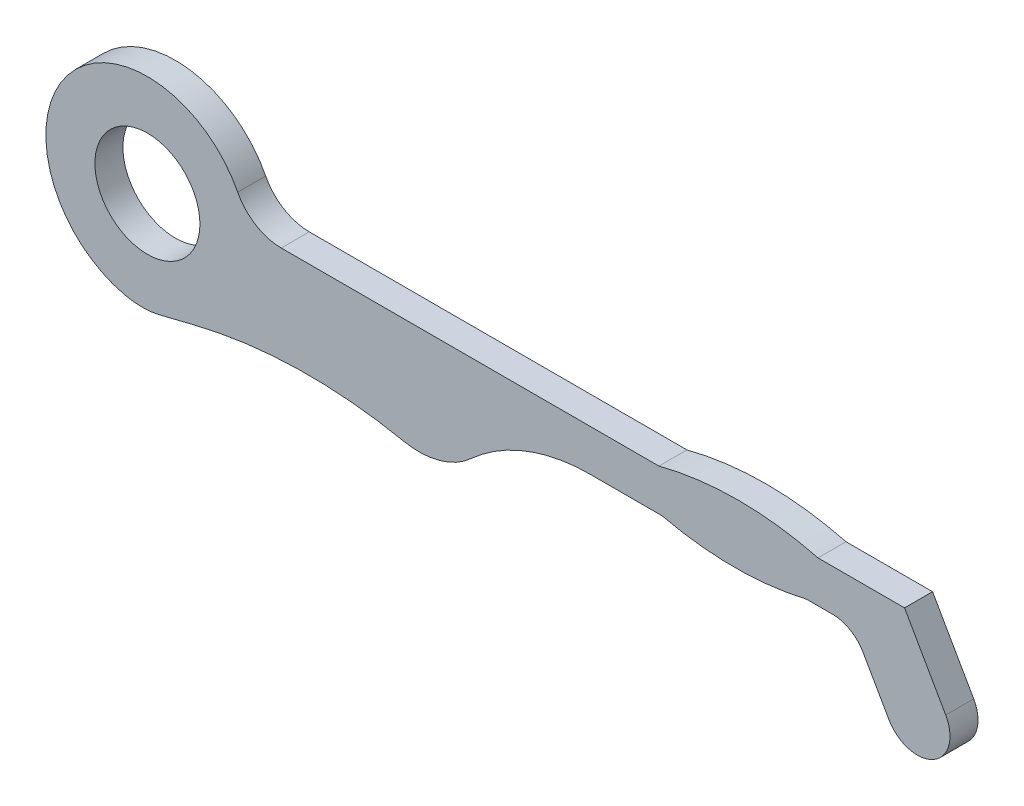
ISO-10303-21;
HEADER;
FILE_DESCRIPTION(('STEP AP214'),'2;1');
FILE_NAME('part.step','',(''),(''),'','','');
FILE_SCHEMA(('AUTOMOTIVE_DESIGN { 1 0 10303 214 1 1 1 1 }'));
ENDSEC;
DATA;
#1=APPLICATION_CONTEXT('core data for automotive mechanical design processes');
#2=APPLICATION_PROTOCOL_DEFINITION('international standard','automotive_design',2000,#1);
#3=PRODUCT_CONTEXT('',#1,'mechanical');
#4=PRODUCT('Part','Part','',(#3));
#5=PRODUCT_RELATED_PRODUCT_CATEGORY('part','',(#4));
#6=PRODUCT_DEFINITION_FORMATION('','',#4);
#7=PRODUCT_DEFINITION_CONTEXT('part definition',#1,'design');
#8=PRODUCT_DEFINITION('design','',#6,#7);
#9=PRODUCT_DEFINITION_SHAPE('','',#8);
#10=(LENGTH_UNIT() NAMED_UNIT(*) SI_UNIT(.MILLI.,.METRE.));
#11=(NAMED_UNIT(*) PLANE_ANGLE_UNIT() SI_UNIT($,.RADIAN.));
#12=(NAMED_UNIT(*) SI_UNIT($,.STERADIAN.) SOLID_ANGLE_UNIT());
#13=UNCERTAINTY_MEASURE_WITH_UNIT(LENGTH_MEASURE(1.E-05),#10,'distance_accuracy_value','');
#14=(GEOMETRIC_REPRESENTATION_CONTEXT(3) GLOBAL_UNCERTAINTY_ASSIGNED_CONTEXT((#13)) GLOBAL_UNIT_ASSIGNED_CONTEXT((#10,
#11,#12)) REPRESENTATION_CONTEXT('',''));
#15=CARTESIAN_POINT('',(0.,0.,0.));
#16=DIRECTION('',(0.,0.,1.));
#17=DIRECTION('',(1.,0.,0.));
#18=AXIS2_PLACEMENT_3D('',#15,#16,#17);
#19=CARTESIAN_POINT('',(2.29199999999996,-7.872,0.4));
#20=DIRECTION('',(0.,0.,1.));
#21=DIRECTION('',(1.,0.,0.));
#22=AXIS2_PLACEMENT_3D('',#19,#20,#21);
#23=PLANE('',#22);
#24=CARTESIAN_POINT('',(0.,0.,0.4));
#25=DIRECTION('',(0.,0.,1.));
#26=DIRECTION('',(1.,0.,0.));
#27=AXIS2_PLACEMENT_3D('',#24,#25,#26);
#28=CIRCLE('',#27,1.45);
#29=CARTESIAN_POINT('',(1.28922379790386,0.663627906976744,0.4));
#30=VERTEX_POINT('',#29);
#31=CARTESIAN_POINT('',(-0.323764830031875,-1.41339178391359,0.4));
#32=VERTEX_POINT('',#31);
#33=EDGE_CURVE('E197',#30,#32,#28,.T.);
#34=ORIENTED_EDGE('',*,*,#33,.T.);
#35=CARTESIAN_POINT('',(-0.0781501313870044,-0.341163534048107,0.4));
#36=DIRECTION('',(0.,0.,1.));
#37=DIRECTION('',(1.,0.,0.));
#38=AXIS2_PLACEMENT_3D('',#35,#36,#37);
#39=CIRCLE('',#38,1.1);
#40=CARTESIAN_POINT('',(0.186791438678388,-1.4087804899135,0.4));
#41=VERTEX_POINT('',#40);
#42=EDGE_CURVE('E279',#32,#41,#39,.T.);
#43=ORIENTED_EDGE('',*,*,#42,.T.);
#44=DIRECTION('',(0.970560868968537,0.240855972786721,0.));
#45=VECTOR('',#44,1.);
#46=CARTESIAN_POINT('',(0.0213238552481499,-1.44984319607237,0.4));
#47=LINE('',#46,#45);
#48=CARTESIAN_POINT('',(0.658996504506038,-1.29159730839331,0.4));
#49=VERTEX_POINT('',#48);
#50=EDGE_CURVE('E199',#41,#49,#47,.T.);
#51=ORIENTED_EDGE('',*,*,#50,.T.);
#52=CARTESIAN_POINT('',(2.29199999999996,-7.872,0.4));
#53=DIRECTION('',(0.,0.,-1.));
#54=DIRECTION('',(1.,0.,0.));
#55=AXIS2_PLACEMENT_3D('',#52,#53,#54);
#56=CIRCLE('',#55,6.78);
#57=CARTESIAN_POINT('',(3.65753171720814,-1.23093659650064,0.4));
#58=VERTEX_POINT('',#57);
#59=EDGE_CURVE('E161',#49,#58,#56,.T.);
#60=ORIENTED_EDGE('',*,*,#59,.T.);
#61=CARTESIAN_POINT('',(3.87907816100297,-0.153477932216085,0.4));
#62=DIRECTION('',(0.,0.,1.));
#63=DIRECTION('',(1.,0.,0.));
#64=AXIS2_PLACEMENT_3D('',#61,#62,#63);
#65=CIRCLE('',#64,1.1);
#66=CARTESIAN_POINT('',(4.61925838224227,-0.967193632006956,0.4));
#67=VERTEX_POINT('',#66);
#68=EDGE_CURVE('E50',#58,#67,#65,.T.);
#69=ORIENTED_EDGE('',*,*,#68,.T.);
#70=CARTESIAN_POINT('',(6.321,-2.83800000000001,0.4));
#71=DIRECTION('',(0.,0.,-1.));
#72=DIRECTION('',(1.,0.,0.));
#73=AXIS2_PLACEMENT_3D('',#70,#71,#72);
#74=CIRCLE('',#73,2.52900000002611);
#75=CARTESIAN_POINT('',(6.321,-0.308999999965196,0.4));
#76=VERTEX_POINT('',#75);
#77=EDGE_CURVE('E151',#67,#76,#74,.T.);
#78=ORIENTED_EDGE('',*,*,#77,.T.);
#79=DIRECTION('',(1.,-3.38153319423875E-11,0.));
#80=VECTOR('',#79,1.);
#81=CARTESIAN_POINT('',(6.321,-0.308999999965196,0.4));
#82=LINE('',#81,#80);
#83=CARTESIAN_POINT('',(7.35023329506406,-0.308999999998916,0.4));
#84=VERTEX_POINT('',#83);
#85=EDGE_CURVE('E156',#76,#84,#82,.T.);
#86=ORIENTED_EDGE('',*,*,#85,.T.);
#87=CARTESIAN_POINT('',(8.38100000000709,4.05799999999318,0.4));
#88=DIRECTION('',(0.,0.,1.));
#89=DIRECTION('',(1.,0.,0.));
#90=AXIS2_PLACEMENT_3D('',#87,#88,#89);
#91=CIRCLE('',#90,4.48699999999443);
#92=CARTESIAN_POINT('',(9.41176670494068,-0.309,0.4));
#93=VERTEX_POINT('',#92);
#94=EDGE_CURVE('E176',#84,#93,#91,.T.);
#95=ORIENTED_EDGE('',*,*,#94,.T.);
#96=DIRECTION('',(1.,2.62217987834939E-11,0.));
#97=VECTOR('',#96,1.);
#98=CARTESIAN_POINT('',(9.41176670494068,-0.309,0.4));
#99=LINE('',#98,#97);
#100=CARTESIAN_POINT('',(9.78501350767704,-0.308999999990213,0.4));
#101=VERTEX_POINT('',#100);
#102=EDGE_CURVE('E178',#93,#101,#99,.T.);
#103=ORIENTED_EDGE('',*,*,#102,.T.);
#104=CARTESIAN_POINT('',(9.78501350769015,-0.808999999990213,0.4));
#105=DIRECTION('',(0.,0.,1.));
#106=DIRECTION('',(1.,0.,0.));
#107=AXIS2_PLACEMENT_3D('',#104,#105,#106);
#108=CIRCLE('',#107,0.5);
#109=CARTESIAN_POINT('',(10.2193941054155,-0.561384377866346,0.4));
#110=VERTEX_POINT('',#109);
#111=EDGE_CURVE('E258',#101,#110,#108,.F.);
#112=ORIENTED_EDGE('',*,*,#111,.T.);
#113=DIRECTION('',(0.495231244247733,-0.868761195450649,0.));
#114=VECTOR('',#113,1.);
#115=CARTESIAN_POINT('',(10.0755241557186,-0.308999999982595,0.4));
#116=LINE('',#115,#114);
#117=CARTESIAN_POINT('',(10.5892885217249,-1.21027299107218,0.4));
#118=VERTEX_POINT('',#117);
#119=EDGE_CURVE('E184',#110,#118,#116,.T.);
#120=ORIENTED_EDGE('',*,*,#119,.T.);
#121=CARTESIAN_POINT('',(10.9950000000042,-0.979000000000476,0.4));
#122=DIRECTION('',(0.,0.,1.));
#123=DIRECTION('',(1.,0.,0.));
#124=AXIS2_PLACEMENT_3D('',#121,#122,#123);
#125=CIRCLE('',#124,0.467000000007259);
#126=CARTESIAN_POINT('',(11.4007114782815,-0.747727008940401,0.4));
#127=VERTEX_POINT('',#126);
#128=EDGE_CURVE('E186',#118,#127,#125,.T.);
#129=ORIENTED_EDGE('',*,*,#128,.T.);
#130=DIRECTION('',(-0.495231244240127,0.868761195454986,0.));
#131=VECTOR('',#130,1.);
#132=CARTESIAN_POINT('',(11.4007114782815,-0.747727008940401,0.4));
#133=LINE('',#132,#131);
#134=CARTESIAN_POINT('',(10.8125827116873,0.283999999988278,0.4));
#135=VERTEX_POINT('',#134);
#136=EDGE_CURVE('E188',#127,#135,#133,.T.);
#137=ORIENTED_EDGE('',*,*,#136,.T.);
#138=DIRECTION('',(-1.,9.48722979068388E-12,0.));
#139=VECTOR('',#138,1.);
#140=CARTESIAN_POINT('',(10.8125827116873,0.283999999988278,0.4));
#141=LINE('',#140,#139);
#142=CARTESIAN_POINT('',(9.57706557907782,0.284,0.4));
#143=VERTEX_POINT('',#142);
#144=EDGE_CURVE('E190',#135,#143,#141,.T.);
#145=ORIENTED_EDGE('',*,*,#144,.T.);
#146=CARTESIAN_POINT('',(8.4410000000024,-4.09400000000457,0.4));
#147=DIRECTION('',(0.,0.,1.));
#148=DIRECTION('',(1.,0.,0.));
#149=AXIS2_PLACEMENT_3D('',#146,#147,#148);
#150=CIRCLE('',#149,4.523);
#151=CARTESIAN_POINT('',(7.30493442092698,0.284,0.4));
#152=VERTEX_POINT('',#151);
#153=EDGE_CURVE('E192',#143,#152,#150,.T.);
#154=ORIENTED_EDGE('',*,*,#153,.T.);
#155=DIRECTION('',(-1.,0.,0.));
#156=VECTOR('',#155,1.);
#157=CARTESIAN_POINT('',(7.30493442092698,0.284,0.4));
#158=LINE('',#157,#156);
#159=CARTESIAN_POINT('',(1.91160770034021,0.284,0.4));
#160=VERTEX_POINT('',#159);
#161=EDGE_CURVE('E194',#152,#160,#158,.T.);
#162=ORIENTED_EDGE('',*,*,#161,.T.);
#163=CARTESIAN_POINT('',(1.91160770034021,0.984,0.4));
#164=DIRECTION('',(0.,0.,1.));
#165=DIRECTION('',(1.,0.,0.));
#166=AXIS2_PLACEMENT_3D('',#163,#164,#165);
#167=CIRCLE('',#166,0.7);
#168=EDGE_CURVE('E267',#160,#30,#167,.F.);
#169=ORIENTED_EDGE('',*,*,#168,.T.);
#170=EDGE_LOOP('',(#34,#43,#51,#60,#69,#78,#86,#95,#103,#112,#120,#129,#137,#145,#154,#162,#169));
#171=FACE_BOUND('',#170,.T.);
#172=CARTESIAN_POINT('',(0.,0.,0.4));
#173=DIRECTION('',(0.,0.,1.));
#174=DIRECTION('',(1.,0.,0.));
#175=AXIS2_PLACEMENT_3D('',#172,#173,#174);
#176=CIRCLE('',#175,0.75);
#177=CARTESIAN_POINT('',(0.75,0.,0.4));
#178=VERTEX_POINT('',#177);
#179=EDGE_CURVE('E204',#178,#178,#176,.T.);
#180=ORIENTED_EDGE('',*,*,#179,.F.);
#181=EDGE_LOOP('',(#180));
#182=FACE_BOUND('',#181,.T.);
#183=ADVANCED_FACE('F35',(#171,#182),#23,.T.);
#184=CARTESIAN_POINT('',(2.29199999999996,-7.872,0.));
#185=DIRECTION('',(0.,0.,1.));
#186=DIRECTION('',(1.,0.,0.));
#187=AXIS2_PLACEMENT_3D('',#184,#185,#186);
#188=PLANE('',#187);
#189=DIRECTION('',(0.970560868968537,0.240855972786721,0.));
#190=VECTOR('',#189,1.);
#191=CARTESIAN_POINT('',(0.0213238552481499,-1.44984319607237,0.));
#192=LINE('',#191,#190);
#193=CARTESIAN_POINT('',(0.186791438678388,-1.4087804899135,0.));
#194=VERTEX_POINT('',#193);
#195=CARTESIAN_POINT('',(0.658996504506038,-1.29159730839331,0.));
#196=VERTEX_POINT('',#195);
#197=EDGE_CURVE('E229',#194,#196,#192,.T.);
#198=ORIENTED_EDGE('',*,*,#197,.F.);
#199=CARTESIAN_POINT('',(-0.0781501313870044,-0.341163534048107,0.));
#200=DIRECTION('',(0.,0.,1.));
#201=DIRECTION('',(1.,0.,0.));
#202=AXIS2_PLACEMENT_3D('',#199,#200,#201);
#203=CIRCLE('',#202,1.1);
#204=CARTESIAN_POINT('',(-0.323764830031875,-1.41339178391359,0.));
#205=VERTEX_POINT('',#204);
#206=EDGE_CURVE('E274',#194,#205,#203,.F.);
#207=ORIENTED_EDGE('',*,*,#206,.T.);
#208=CARTESIAN_POINT('',(0.,0.,0.));
#209=DIRECTION('',(0.,0.,1.));
#210=DIRECTION('',(1.,0.,0.));
#211=AXIS2_PLACEMENT_3D('',#208,#209,#210);
#212=CIRCLE('',#211,1.45);
#213=CARTESIAN_POINT('',(1.28922379790386,0.663627906976744,0.));
#214=VERTEX_POINT('',#213);
#215=EDGE_CURVE('E226',#214,#205,#212,.T.);
#216=ORIENTED_EDGE('',*,*,#215,.F.);
#217=CARTESIAN_POINT('',(1.91160770034021,0.984,0.));
#218=DIRECTION('',(0.,0.,1.));
#219=DIRECTION('',(1.,0.,0.));
#220=AXIS2_PLACEMENT_3D('',#217,#218,#219);
#221=CIRCLE('',#220,0.7);
#222=CARTESIAN_POINT('',(1.91160770034021,0.284,0.));
#223=VERTEX_POINT('',#222);
#224=EDGE_CURVE('E265',#214,#223,#221,.T.);
#225=ORIENTED_EDGE('',*,*,#224,.T.);
#226=DIRECTION('',(-1.,0.,0.));
#227=VECTOR('',#226,1.);
#228=CARTESIAN_POINT('',(7.30493442092698,0.284,0.));
#229=LINE('',#228,#227);
#230=CARTESIAN_POINT('',(7.30493442092698,0.284,0.));
#231=VERTEX_POINT('',#230);
#232=EDGE_CURVE('E223',#231,#223,#229,.T.);
#233=ORIENTED_EDGE('',*,*,#232,.F.);
#234=CARTESIAN_POINT('',(8.4410000000024,-4.09400000000457,0.));
#235=DIRECTION('',(0.,0.,1.));
#236=DIRECTION('',(1.,0.,0.));
#237=AXIS2_PLACEMENT_3D('',#234,#235,#236);
#238=CIRCLE('',#237,4.523);
#239=CARTESIAN_POINT('',(9.57706557907782,0.284,0.));
#240=VERTEX_POINT('',#239);
#241=EDGE_CURVE('E221',#240,#231,#238,.T.);
#242=ORIENTED_EDGE('',*,*,#241,.F.);
#243=DIRECTION('',(-1.,9.48722979068388E-12,0.));
#244=VECTOR('',#243,1.);
#245=CARTESIAN_POINT('',(10.8125827116873,0.283999999988278,0.));
#246=LINE('',#245,#244);
#247=CARTESIAN_POINT('',(10.8125827116873,0.283999999988278,0.));
#248=VERTEX_POINT('',#247);
#249=EDGE_CURVE('E219',#248,#240,#246,.T.);
#250=ORIENTED_EDGE('',*,*,#249,.F.);
#251=DIRECTION('',(-0.495231244240127,0.868761195454986,0.));
#252=VECTOR('',#251,1.);
#253=CARTESIAN_POINT('',(11.4007114782815,-0.747727008940401,0.));
#254=LINE('',#253,#252);
#255=CARTESIAN_POINT('',(11.4007114782815,-0.747727008940401,0.));
#256=VERTEX_POINT('',#255);
#257=EDGE_CURVE('E217',#256,#248,#254,.T.);
#258=ORIENTED_EDGE('',*,*,#257,.F.);
#259=CARTESIAN_POINT('',(10.9950000000042,-0.979000000000476,0.));
#260=DIRECTION('',(0.,0.,1.));
#261=DIRECTION('',(1.,0.,0.));
#262=AXIS2_PLACEMENT_3D('',#259,#260,#261);
#263=CIRCLE('',#262,0.467000000007259);
#264=CARTESIAN_POINT('',(10.5892885217249,-1.21027299107218,0.));
#265=VERTEX_POINT('',#264);
#266=EDGE_CURVE('E215',#265,#256,#263,.T.);
#267=ORIENTED_EDGE('',*,*,#266,.F.);
#268=DIRECTION('',(0.495231244247733,-0.868761195450649,0.));
#269=VECTOR('',#268,1.);
#270=CARTESIAN_POINT('',(10.0755241557186,-0.308999999982595,0.));
#271=LINE('',#270,#269);
#272=CARTESIAN_POINT('',(10.2193941054155,-0.561384377866346,0.));
#273=VERTEX_POINT('',#272);
#274=EDGE_CURVE('E213',#273,#265,#271,.T.);
#275=ORIENTED_EDGE('',*,*,#274,.F.);
#276=CARTESIAN_POINT('',(9.78501350769015,-0.808999999990213,0.));
#277=DIRECTION('',(0.,0.,1.));
#278=DIRECTION('',(1.,0.,0.));
#279=AXIS2_PLACEMENT_3D('',#276,#277,#278);
#280=CIRCLE('',#279,0.5);
#281=CARTESIAN_POINT('',(9.78501350767704,-0.308999999990213,0.));
#282=VERTEX_POINT('',#281);
#283=EDGE_CURVE('E256',#273,#282,#280,.T.);
#284=ORIENTED_EDGE('',*,*,#283,.T.);
#285=DIRECTION('',(1.,2.62217987834939E-11,0.));
#286=VECTOR('',#285,1.);
#287=CARTESIAN_POINT('',(9.41176670494068,-0.309,0.));
#288=LINE('',#287,#286);
#289=CARTESIAN_POINT('',(9.41176670494068,-0.309,0.));
#290=VERTEX_POINT('',#289);
#291=EDGE_CURVE('E210',#290,#282,#288,.T.);
#292=ORIENTED_EDGE('',*,*,#291,.F.);
#293=CARTESIAN_POINT('',(8.38100000000709,4.05799999999318,0.));
#294=DIRECTION('',(0.,0.,1.));
#295=DIRECTION('',(1.,0.,0.));
#296=AXIS2_PLACEMENT_3D('',#293,#294,#295);
#297=CIRCLE('',#296,4.48699999999443);
#298=CARTESIAN_POINT('',(7.35023329506406,-0.308999999998916,0.));
#299=VERTEX_POINT('',#298);
#300=EDGE_CURVE('E208',#299,#290,#297,.T.);
#301=ORIENTED_EDGE('',*,*,#300,.F.);
#302=DIRECTION('',(1.,-3.38153319423875E-11,0.));
#303=VECTOR('',#302,1.);
#304=CARTESIAN_POINT('',(6.321,-0.308999999965196,0.));
#305=LINE('',#304,#303);
#306=CARTESIAN_POINT('',(6.321,-0.308999999965196,0.));
#307=VERTEX_POINT('',#306);
#308=EDGE_CURVE('E206',#307,#299,#305,.T.);
#309=ORIENTED_EDGE('',*,*,#308,.F.);
#310=CARTESIAN_POINT('',(6.321,-2.83800000000001,0.));
#311=DIRECTION('',(0.,0.,-1.));
#312=DIRECTION('',(1.,0.,0.));
#313=AXIS2_PLACEMENT_3D('',#310,#311,#312);
#314=CIRCLE('',#313,2.52900000002611);
#315=CARTESIAN_POINT('',(4.61925838224227,-0.967193632006956,0.));
#316=VERTEX_POINT('',#315);
#317=EDGE_CURVE('E167',#316,#307,#314,.T.);
#318=ORIENTED_EDGE('',*,*,#317,.F.);
#319=CARTESIAN_POINT('',(3.87907816100297,-0.153477932216085,0.));
#320=DIRECTION('',(0.,0.,1.));
#321=DIRECTION('',(1.,0.,0.));
#322=AXIS2_PLACEMENT_3D('',#319,#320,#321);
#323=CIRCLE('',#322,1.1);
#324=CARTESIAN_POINT('',(3.65753171720814,-1.23093659650064,0.));
#325=VERTEX_POINT('',#324);
#326=EDGE_CURVE('E272',#316,#325,#323,.F.);
#327=ORIENTED_EDGE('',*,*,#326,.T.);
#328=CARTESIAN_POINT('',(2.29199999999996,-7.872,0.));
#329=DIRECTION('',(0.,0.,-1.));
#330=DIRECTION('',(1.,0.,0.));
#331=AXIS2_PLACEMENT_3D('',#328,#329,#330);
#332=CIRCLE('',#331,6.78);
#333=EDGE_CURVE('E202',#196,#325,#332,.T.);
#334=ORIENTED_EDGE('',*,*,#333,.F.);
#335=EDGE_LOOP('',(#198,#207,#216,#225,#233,#242,#250,#258,#267,#275,#284,#292,#301,#309,#318,
#327,#334));
#336=FACE_BOUND('',#335,.T.);
#337=CARTESIAN_POINT('',(0.,0.,0.));
#338=DIRECTION('',(0.,0.,1.));
#339=DIRECTION('',(1.,0.,0.));
#340=AXIS2_PLACEMENT_3D('',#337,#338,#339);
#341=CIRCLE('',#340,0.75);
#342=CARTESIAN_POINT('',(0.75,0.,0.));
#343=VERTEX_POINT('',#342);
#344=EDGE_CURVE('E512',#343,#343,#341,.T.);
#345=ORIENTED_EDGE('',*,*,#344,.T.);
#346=EDGE_LOOP('',(#345));
#347=FACE_BOUND('',#346,.T.);
#348=ADVANCED_FACE('F283',(#336,#347),#188,.F.);
#349=CARTESIAN_POINT('',(2.29199999999996,-7.872,0.4));
#350=DIRECTION('',(0.,0.,-1.));
#351=DIRECTION('',(-1.,0.,0.));
#352=AXIS2_PLACEMENT_3D('',#349,#350,#351);
#353=CYLINDRICAL_SURFACE('',#352,6.78);
#354=ORIENTED_EDGE('',*,*,#333,.T.);
#355=DIRECTION('',(0.,0.,-1.));
#356=VECTOR('',#355,1.);
#357=CARTESIAN_POINT('',(3.65753171720814,-1.23093659650064,0.4));
#358=LINE('',#357,#356);
#359=EDGE_CURVE('E11',#325,#58,#358,.F.);
#360=ORIENTED_EDGE('',*,*,#359,.T.);
#361=ORIENTED_EDGE('',*,*,#59,.F.);
#362=DIRECTION('',(0.,0.,-1.));
#363=VECTOR('',#362,1.);
#364=CARTESIAN_POINT('',(0.658996504506038,-1.29159730839331,0.4));
#365=LINE('',#364,#363);
#366=EDGE_CURVE('E201',#49,#196,#365,.T.);
#367=ORIENTED_EDGE('',*,*,#366,.T.);
#368=EDGE_LOOP('',(#354,#360,#361,#367));
#369=FACE_BOUND('',#368,.T.);
#370=ADVANCED_FACE('F354',(#369),#353,.F.);
#371=CARTESIAN_POINT('',(6.321,-2.83800000000001,0.4));
#372=DIRECTION('',(0.,0.,-1.));
#373=DIRECTION('',(-1.,0.,0.));
#374=AXIS2_PLACEMENT_3D('',#371,#372,#373);
#375=CYLINDRICAL_SURFACE('',#374,2.52900000002611);
#376=ORIENTED_EDGE('',*,*,#77,.F.);
#377=DIRECTION('',(0.,0.,-1.));
#378=VECTOR('',#377,1.);
#379=CARTESIAN_POINT('',(4.61925838224227,-0.967193632006956,0.4));
#380=LINE('',#379,#378);
#381=EDGE_CURVE('E43',#67,#316,#380,.T.);
#382=ORIENTED_EDGE('',*,*,#381,.T.);
#383=ORIENTED_EDGE('',*,*,#317,.T.);
#384=DIRECTION('',(0.,0.,-1.));
#385=VECTOR('',#384,1.);
#386=CARTESIAN_POINT('',(6.321,-0.308999999965196,0.4));
#387=LINE('',#386,#385);
#388=EDGE_CURVE('E164',#76,#307,#387,.T.);
#389=ORIENTED_EDGE('',*,*,#388,.F.);
#390=EDGE_LOOP('',(#376,#382,#383,#389));
#391=FACE_BOUND('',#390,.T.);
#392=ADVANCED_FACE('F165',(#391),#375,.F.);
#393=CARTESIAN_POINT('',(6.321,-0.308999999965196,0.4));
#394=DIRECTION('',(3.38153319423875E-11,1.,0.));
#395=DIRECTION('',(-1.,3.38153319423875E-11,0.));
#396=AXIS2_PLACEMENT_3D('',#393,#394,#395);
#397=PLANE('',#396);
#398=ORIENTED_EDGE('',*,*,#308,.T.);
#399=DIRECTION('',(0.,0.,-1.));
#400=VECTOR('',#399,1.);
#401=CARTESIAN_POINT('',(7.35023329506406,-0.308999999998916,0.4));
#402=LINE('',#401,#400);
#403=EDGE_CURVE('E171',#84,#299,#402,.T.);
#404=ORIENTED_EDGE('',*,*,#403,.F.);
#405=ORIENTED_EDGE('',*,*,#85,.F.);
#406=ORIENTED_EDGE('',*,*,#388,.T.);
#407=EDGE_LOOP('',(#398,#404,#405,#406));
#408=FACE_BOUND('',#407,.T.);
#409=ADVANCED_FACE('F173',(#408),#397,.F.);
#410=CARTESIAN_POINT('',(8.38100000000709,4.05799999999318,0.4));
#411=DIRECTION('',(0.,0.,-1.));
#412=DIRECTION('',(-1.,0.,0.));
#413=AXIS2_PLACEMENT_3D('',#410,#411,#412);
#414=CYLINDRICAL_SURFACE('',#413,4.48699999999443);
#415=ORIENTED_EDGE('',*,*,#300,.T.);
#416=DIRECTION('',(0.,0.,-1.));
#417=VECTOR('',#416,1.);
#418=CARTESIAN_POINT('',(9.41176670494068,-0.309,0.4));
#419=LINE('',#418,#417);
#420=EDGE_CURVE('E248',#93,#290,#419,.T.);
#421=ORIENTED_EDGE('',*,*,#420,.F.);
#422=ORIENTED_EDGE('',*,*,#94,.F.);
#423=ORIENTED_EDGE('',*,*,#403,.T.);
#424=EDGE_LOOP('',(#415,#421,#422,#423));
#425=FACE_BOUND('',#424,.T.);
#426=ADVANCED_FACE('F289',(#425),#414,.T.);
#427=CARTESIAN_POINT('',(9.41176670494068,-0.309,0.4));
#428=DIRECTION('',(-2.62217987834939E-11,1.,0.));
#429=DIRECTION('',(-1.,-2.62217987834939E-11,0.));
#430=AXIS2_PLACEMENT_3D('',#427,#428,#429);
#431=PLANE('',#430);
#432=ORIENTED_EDGE('',*,*,#291,.T.);
#433=DIRECTION('',(0.,0.,-1.));
#434=VECTOR('',#433,1.);
#435=CARTESIAN_POINT('',(9.78501350767704,-0.308999999990213,0.4));
#436=LINE('',#435,#434);
#437=EDGE_CURVE('E254',#282,#101,#436,.F.);
#438=ORIENTED_EDGE('',*,*,#437,.T.);
#439=ORIENTED_EDGE('',*,*,#102,.F.);
#440=ORIENTED_EDGE('',*,*,#420,.T.);
#441=EDGE_LOOP('',(#432,#438,#439,#440));
#442=FACE_BOUND('',#441,.T.);
#443=ADVANCED_FACE('F375',(#442),#431,.F.);
#444=CARTESIAN_POINT('',(10.0755241557186,-0.308999999982595,0.4));
#445=DIRECTION('',(0.86876119545065,0.495231244247733,0.));
#446=DIRECTION('',(-0.495231244247733,0.86876119545065,0.));
#447=AXIS2_PLACEMENT_3D('',#444,#445,#446);
#448=PLANE('',#447);
#449=ORIENTED_EDGE('',*,*,#119,.F.);
#450=DIRECTION('',(0.,0.,-1.));
#451=VECTOR('',#450,1.);
#452=CARTESIAN_POINT('',(10.2193941054155,-0.561384377866346,0.));
#453=LINE('',#452,#451);
#454=EDGE_CURVE('E170',#110,#273,#453,.T.);
#455=ORIENTED_EDGE('',*,*,#454,.T.);
#456=ORIENTED_EDGE('',*,*,#274,.T.);
#457=DIRECTION('',(0.,0.,-1.));
#458=VECTOR('',#457,1.);
#459=CARTESIAN_POINT('',(10.5892885217249,-1.21027299107218,0.4));
#460=LINE('',#459,#458);
#461=EDGE_CURVE('E245',#118,#265,#460,.T.);
#462=ORIENTED_EDGE('',*,*,#461,.F.);
#463=EDGE_LOOP('',(#449,#455,#456,#462));
#464=FACE_BOUND('',#463,.T.);
#465=ADVANCED_FACE('F301',(#464),#448,.F.);
#466=CARTESIAN_POINT('',(10.9950000000042,-0.979000000000476,0.4));
#467=DIRECTION('',(0.,0.,-1.));
#468=DIRECTION('',(-1.,0.,0.));
#469=AXIS2_PLACEMENT_3D('',#466,#467,#468);
#470=CYLINDRICAL_SURFACE('',#469,0.467000000007259);
#471=ORIENTED_EDGE('',*,*,#266,.T.);
#472=DIRECTION('',(0.,0.,-1.));
#473=VECTOR('',#472,1.);
#474=CARTESIAN_POINT('',(11.4007114782815,-0.747727008940401,0.4));
#475=LINE('',#474,#473);
#476=EDGE_CURVE('E242',#127,#256,#475,.T.);
#477=ORIENTED_EDGE('',*,*,#476,.F.);
#478=ORIENTED_EDGE('',*,*,#128,.F.);
#479=ORIENTED_EDGE('',*,*,#461,.T.);
#480=EDGE_LOOP('',(#471,#477,#478,#479));
#481=FACE_BOUND('',#480,.T.);
#482=ADVANCED_FACE('F308',(#481),#470,.T.);
#483=CARTESIAN_POINT('',(11.4007114782815,-0.747727008940401,0.4));
#484=DIRECTION('',(-0.868761195454986,-0.495231244240127,0.));
#485=DIRECTION('',(0.495231244240127,-0.868761195454986,0.));
#486=AXIS2_PLACEMENT_3D('',#483,#484,#485);
#487=PLANE('',#486);
#488=ORIENTED_EDGE('',*,*,#257,.T.);
#489=DIRECTION('',(0.,0.,-1.));
#490=VECTOR('',#489,1.);
#491=CARTESIAN_POINT('',(10.8125827116873,0.283999999988278,0.4));
#492=LINE('',#491,#490);
#493=EDGE_CURVE('E239',#135,#248,#492,.T.);
#494=ORIENTED_EDGE('',*,*,#493,.F.);
#495=ORIENTED_EDGE('',*,*,#136,.F.);
#496=ORIENTED_EDGE('',*,*,#476,.T.);
#497=EDGE_LOOP('',(#488,#494,#495,#496));
#498=FACE_BOUND('',#497,.T.);
#499=ADVANCED_FACE('F312',(#498),#487,.F.);
#500=CARTESIAN_POINT('',(10.8125827116873,0.283999999988278,0.4));
#501=DIRECTION('',(-9.48722979068388E-12,-1.,0.));
#502=DIRECTION('',(1.,-9.48722979068388E-12,0.));
#503=AXIS2_PLACEMENT_3D('',#500,#501,#502);
#504=PLANE('',#503);
#505=ORIENTED_EDGE('',*,*,#249,.T.);
#506=DIRECTION('',(0.,0.,-1.));
#507=VECTOR('',#506,1.);
#508=CARTESIAN_POINT('',(9.57706557907782,0.284,0.4));
#509=LINE('',#508,#507);
#510=EDGE_CURVE('E236',#143,#240,#509,.T.);
#511=ORIENTED_EDGE('',*,*,#510,.F.);
#512=ORIENTED_EDGE('',*,*,#144,.F.);
#513=ORIENTED_EDGE('',*,*,#493,.T.);
#514=EDGE_LOOP('',(#505,#511,#512,#513));
#515=FACE_BOUND('',#514,.T.);
#516=ADVANCED_FACE('F319',(#515),#504,.F.);
#517=CARTESIAN_POINT('',(8.4410000000024,-4.09400000000457,0.4));
#518=DIRECTION('',(0.,0.,-1.));
#519=DIRECTION('',(-1.,0.,0.));
#520=AXIS2_PLACEMENT_3D('',#517,#518,#519);
#521=CYLINDRICAL_SURFACE('',#520,4.523);
#522=ORIENTED_EDGE('',*,*,#241,.T.);
#523=DIRECTION('',(0.,0.,-1.));
#524=VECTOR('',#523,1.);
#525=CARTESIAN_POINT('',(7.30493442092698,0.284,0.4));
#526=LINE('',#525,#524);
#527=EDGE_CURVE('E233',#152,#231,#526,.T.);
#528=ORIENTED_EDGE('',*,*,#527,.F.);
#529=ORIENTED_EDGE('',*,*,#153,.F.);
#530=ORIENTED_EDGE('',*,*,#510,.T.);
#531=EDGE_LOOP('',(#522,#528,#529,#530));
#532=FACE_BOUND('',#531,.T.);
#533=ADVANCED_FACE('F322',(#532),#521,.T.);
#534=CARTESIAN_POINT('',(7.30493442092698,0.284,0.4));
#535=DIRECTION('',(0.,-1.,0.));
#536=DIRECTION('',(1.,0.,0.));
#537=AXIS2_PLACEMENT_3D('',#534,#535,#536);
#538=PLANE('',#537);
#539=ORIENTED_EDGE('',*,*,#232,.T.);
#540=DIRECTION('',(0.,0.,1.));
#541=VECTOR('',#540,1.);
#542=CARTESIAN_POINT('',(1.91160770034021,0.284,0.4));
#543=LINE('',#542,#541);
#544=EDGE_CURVE('E263',#223,#160,#543,.T.);
#545=ORIENTED_EDGE('',*,*,#544,.T.);
#546=ORIENTED_EDGE('',*,*,#161,.F.);
#547=ORIENTED_EDGE('',*,*,#527,.T.);
#548=EDGE_LOOP('',(#539,#545,#546,#547));
#549=FACE_BOUND('',#548,.T.);
#550=ADVANCED_FACE('F326',(#549),#538,.F.);
#551=CARTESIAN_POINT('',(0.,0.,0.4));
#552=DIRECTION('',(0.,0.,-1.));
#553=DIRECTION('',(-1.,0.,0.));
#554=AXIS2_PLACEMENT_3D('',#551,#552,#553);
#555=CYLINDRICAL_SURFACE('',#554,1.45);
#556=ORIENTED_EDGE('',*,*,#215,.T.);
#557=DIRECTION('',(0.,0.,-1.));
#558=VECTOR('',#557,1.);
#559=CARTESIAN_POINT('',(-0.323764830031875,-1.41339178391359,0.4));
#560=LINE('',#559,#558);
#561=EDGE_CURVE('E276',#205,#32,#560,.F.);
#562=ORIENTED_EDGE('',*,*,#561,.T.);
#563=ORIENTED_EDGE('',*,*,#33,.F.);
#564=DIRECTION('',(0.,0.,-1.));
#565=VECTOR('',#564,1.);
#566=CARTESIAN_POINT('',(1.28922379790387,0.663627906976744,0.4));
#567=LINE('',#566,#565);
#568=EDGE_CURVE('E260',#30,#214,#567,.T.);
#569=ORIENTED_EDGE('',*,*,#568,.T.);
#570=EDGE_LOOP('',(#556,#562,#563,#569));
#571=FACE_BOUND('',#570,.T.);
#572=ADVANCED_FACE('F335',(#571),#555,.T.);
#573=CARTESIAN_POINT('',(0.0213238552481499,-1.44984319607237,0.4));
#574=DIRECTION('',(-0.240855972786721,0.970560868968538,0.));
#575=DIRECTION('',(-0.970560868968538,-0.240855972786721,0.));
#576=AXIS2_PLACEMENT_3D('',#573,#574,#575);
#577=PLANE('',#576);
#578=ORIENTED_EDGE('',*,*,#50,.F.);
#579=DIRECTION('',(0.,0.,-1.));
#580=VECTOR('',#579,1.);
#581=CARTESIAN_POINT('',(0.186791438678388,-1.4087804899135,0.4));
#582=LINE('',#581,#580);
#583=EDGE_CURVE('E269',#41,#194,#582,.T.);
#584=ORIENTED_EDGE('',*,*,#583,.T.);
#585=ORIENTED_EDGE('',*,*,#197,.T.);
#586=ORIENTED_EDGE('',*,*,#366,.F.);
#587=EDGE_LOOP('',(#578,#584,#585,#586));
#588=FACE_BOUND('',#587,.T.);
#589=ADVANCED_FACE('F343',(#588),#577,.F.);
#590=CARTESIAN_POINT('',(0.,0.,0.401));
#591=DIRECTION('',(0.,0.,-1.));
#592=DIRECTION('',(-1.,0.,0.));
#593=AXIS2_PLACEMENT_3D('',#590,#591,#592);
#594=CYLINDRICAL_SURFACE('',#593,0.75);
#595=ORIENTED_EDGE('',*,*,#179,.T.);
#596=EDGE_LOOP('',(#595));
#597=FACE_BOUND('',#596,.T.);
#598=ORIENTED_EDGE('',*,*,#344,.F.);
#599=EDGE_LOOP('',(#598));
#600=FACE_BOUND('',#599,.T.);
#601=ADVANCED_FACE('F357',(#597,#600),#594,.F.);
#602=CARTESIAN_POINT('',(9.78501350769015,-0.808999999990213,0.4));
#603=DIRECTION('',(0.,0.,1.));
#604=DIRECTION('',(1.,0.,0.));
#605=AXIS2_PLACEMENT_3D('',#602,#603,#604);
#606=CYLINDRICAL_SURFACE('',#605,0.5);
#607=ORIENTED_EDGE('',*,*,#111,.F.);
#608=ORIENTED_EDGE('',*,*,#437,.F.);
#609=ORIENTED_EDGE('',*,*,#283,.F.);
#610=ORIENTED_EDGE('',*,*,#454,.F.);
#611=EDGE_LOOP('',(#607,#608,#609,#610));
#612=FACE_BOUND('',#611,.T.);
#613=ADVANCED_FACE('F298',(#612),#606,.F.);
#614=CARTESIAN_POINT('',(1.91160770034021,0.984,0.4));
#615=DIRECTION('',(0.,0.,-1.));
#616=DIRECTION('',(-1.,0.,0.));
#617=AXIS2_PLACEMENT_3D('',#614,#615,#616);
#618=CYLINDRICAL_SURFACE('',#617,0.7);
#619=ORIENTED_EDGE('',*,*,#168,.F.);
#620=ORIENTED_EDGE('',*,*,#544,.F.);
#621=ORIENTED_EDGE('',*,*,#224,.F.);
#622=ORIENTED_EDGE('',*,*,#568,.F.);
#623=EDGE_LOOP('',(#619,#620,#621,#622));
#624=FACE_BOUND('',#623,.T.);
#625=ADVANCED_FACE('F332',(#624),#618,.F.);
#626=CARTESIAN_POINT('',(-0.0781501313870044,-0.341163534048107,0.4));
#627=DIRECTION('',(0.,0.,-1.));
#628=DIRECTION('',(-1.,0.,0.));
#629=AXIS2_PLACEMENT_3D('',#626,#627,#628);
#630=CYLINDRICAL_SURFACE('',#629,1.1);
#631=ORIENTED_EDGE('',*,*,#42,.F.);
#632=ORIENTED_EDGE('',*,*,#561,.F.);
#633=ORIENTED_EDGE('',*,*,#206,.F.);
#634=ORIENTED_EDGE('',*,*,#583,.F.);
#635=EDGE_LOOP('',(#631,#632,#633,#634));
#636=FACE_BOUND('',#635,.T.);
#637=ADVANCED_FACE('F340',(#636),#630,.T.);
#638=CARTESIAN_POINT('',(3.87907816100297,-0.153477932216085,0.4));
#639=DIRECTION('',(0.,0.,-1.));
#640=DIRECTION('',(-1.,0.,0.));
#641=AXIS2_PLACEMENT_3D('',#638,#639,#640);
#642=CYLINDRICAL_SURFACE('',#641,1.1);
#643=ORIENTED_EDGE('',*,*,#68,.F.);
#644=ORIENTED_EDGE('',*,*,#359,.F.);
#645=ORIENTED_EDGE('',*,*,#326,.F.);
#646=ORIENTED_EDGE('',*,*,#381,.F.);
#647=EDGE_LOOP('',(#643,#644,#645,#646));
#648=FACE_BOUND('',#647,.T.);
#649=ADVANCED_FACE('F37',(#648),#642,.T.);
#650=CLOSED_SHELL('',(#183,#348,#370,#392,#409,#426,#443,#465,#482,#499,#516,#533,#550,#572,
#589,#601,#613,#625,#637,#649));
#651=MANIFOLD_SOLID_BREP('B2',#650);
#652=ADVANCED_BREP_SHAPE_REPRESENTATION('',(#18,#651),#14);
#653=SHAPE_DEFINITION_REPRESENTATION(#9,#652);
ENDSEC;
END-ISO-10303-21;
